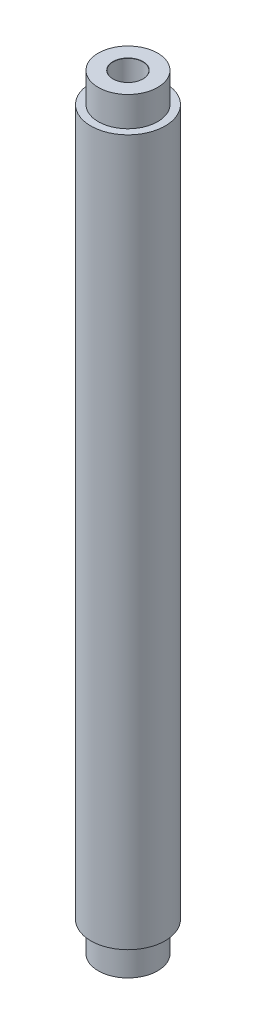
ISO-10303-21;
HEADER;
FILE_DESCRIPTION(('STEP AP214'),'2;1');
FILE_NAME('part.step','',(''),(''),'','','');
FILE_SCHEMA(('AUTOMOTIVE_DESIGN { 1 0 10303 214 1 1 1 1 }'));
ENDSEC;
DATA;
#1=APPLICATION_CONTEXT('core data for automotive mechanical design processes');
#2=APPLICATION_PROTOCOL_DEFINITION('international standard','automotive_design',2000,#1);
#3=PRODUCT_CONTEXT('',#1,'mechanical');
#4=PRODUCT('Part','Part','',(#3));
#5=PRODUCT_RELATED_PRODUCT_CATEGORY('part','',(#4));
#6=PRODUCT_DEFINITION_FORMATION('','',#4);
#7=PRODUCT_DEFINITION_CONTEXT('part definition',#1,'design');
#8=PRODUCT_DEFINITION('design','',#6,#7);
#9=PRODUCT_DEFINITION_SHAPE('','',#8);
#10=(LENGTH_UNIT() NAMED_UNIT(*) SI_UNIT(.MILLI.,.METRE.));
#11=(NAMED_UNIT(*) PLANE_ANGLE_UNIT() SI_UNIT($,.RADIAN.));
#12=(NAMED_UNIT(*) SI_UNIT($,.STERADIAN.) SOLID_ANGLE_UNIT());
#13=UNCERTAINTY_MEASURE_WITH_UNIT(LENGTH_MEASURE(1.E-05),#10,'distance_accuracy_value','');
#14=(GEOMETRIC_REPRESENTATION_CONTEXT(3) GLOBAL_UNCERTAINTY_ASSIGNED_CONTEXT((#13)) GLOBAL_UNIT_ASSIGNED_CONTEXT((#10,
#11,#12)) REPRESENTATION_CONTEXT('',''));
#15=CARTESIAN_POINT('',(0.,0.,0.));
#16=DIRECTION('',(0.,0.,1.));
#17=DIRECTION('',(1.,0.,0.));
#18=AXIS2_PLACEMENT_3D('',#15,#16,#17);
#19=CARTESIAN_POINT('',(0.,103.,0.));
#20=DIRECTION('',(0.,1.,0.));
#21=DIRECTION('',(0.,0.,1.));
#22=AXIS2_PLACEMENT_3D('',#19,#20,#21);
#23=PLANE('',#22);
#24=CARTESIAN_POINT('',(0.,103.,0.));
#25=DIRECTION('',(0.,1.,0.));
#26=DIRECTION('',(0.,0.,1.));
#27=AXIS2_PLACEMENT_3D('',#24,#25,#26);
#28=CIRCLE('',#27,2.025);
#29=CARTESIAN_POINT('',(0.,103.,2.025));
#30=VERTEX_POINT('',#29);
#31=EDGE_CURVE('E811',#30,#30,#28,.T.);
#32=ORIENTED_EDGE('',*,*,#31,.F.);
#33=EDGE_LOOP('',(#32));
#34=FACE_BOUND('',#33,.T.);
#35=CARTESIAN_POINT('',(0.,103.,0.));
#36=DIRECTION('',(0.,1.,0.));
#37=DIRECTION('',(-1.,0.,0.));
#38=AXIS2_PLACEMENT_3D('',#35,#36,#37);
#39=CIRCLE('',#38,4.);
#40=CARTESIAN_POINT('',(-4.00000000000001,103.,0.));
#41=VERTEX_POINT('',#40);
#42=EDGE_CURVE('E845',#41,#41,#39,.T.);
#43=ORIENTED_EDGE('',*,*,#42,.T.);
#44=EDGE_LOOP('',(#43));
#45=FACE_BOUND('',#44,.T.);
#46=ADVANCED_FACE('F785',(#34,#45),#23,.T.);
#47=CARTESIAN_POINT('',(0.,85.,0.));
#48=DIRECTION('',(0.,1.,0.));
#49=DIRECTION('',(0.,0.,1.));
#50=AXIS2_PLACEMENT_3D('',#47,#48,#49);
#51=CONICAL_SURFACE('',#50,2.,1.02974425867665);
#52=CARTESIAN_POINT('',(0.,83.7982787619449,0.));
#53=VERTEX_POINT('',#52);
#54=VERTEX_LOOP('',#53);
#55=FACE_BOUND('',#54,.T.);
#56=CARTESIAN_POINT('',(0.,85.,0.));
#57=DIRECTION('',(0.,1.,0.));
#58=DIRECTION('',(0.,0.,1.));
#59=AXIS2_PLACEMENT_3D('',#56,#57,#58);
#60=CIRCLE('',#59,2.);
#61=CARTESIAN_POINT('',(0.,85.,2.));
#62=VERTEX_POINT('',#61);
#63=EDGE_CURVE('E12',#62,#62,#60,.T.);
#64=ORIENTED_EDGE('',*,*,#63,.T.);
#65=EDGE_LOOP('',(#64));
#66=FACE_BOUND('',#65,.T.);
#67=ADVANCED_FACE('F841',(#55,#66),#51,.F.);
#68=CARTESIAN_POINT('',(0.,103.,0.));
#69=DIRECTION('',(0.,1.,0.));
#70=DIRECTION('',(0.,0.,1.));
#71=AXIS2_PLACEMENT_3D('',#68,#69,#70);
#72=CYLINDRICAL_SURFACE('',#71,2.);
#73=ORIENTED_EDGE('',*,*,#63,.F.);
#74=EDGE_LOOP('',(#73));
#75=FACE_BOUND('',#74,.T.);
#76=CARTESIAN_POINT('',(0.,102.975,0.));
#77=DIRECTION('',(0.,1.,0.));
#78=DIRECTION('',(0.,0.,1.));
#79=AXIS2_PLACEMENT_3D('',#76,#77,#78);
#80=CIRCLE('',#79,2.);
#81=CARTESIAN_POINT('',(0.,102.975,2.));
#82=VERTEX_POINT('',#81);
#83=EDGE_CURVE('E794',#82,#82,#80,.T.);
#84=ORIENTED_EDGE('',*,*,#83,.T.);
#85=EDGE_LOOP('',(#84));
#86=FACE_BOUND('',#85,.T.);
#87=ADVANCED_FACE('F830',(#75,#86),#72,.F.);
#88=CARTESIAN_POINT('',(0.,103.,0.));
#89=DIRECTION('',(0.,1.,0.));
#90=DIRECTION('',(0.,0.,1.));
#91=AXIS2_PLACEMENT_3D('',#88,#89,#90);
#92=CONICAL_SURFACE('',#91,2.025,0.785398163397526);
#93=ORIENTED_EDGE('',*,*,#83,.F.);
#94=EDGE_LOOP('',(#93));
#95=FACE_BOUND('',#94,.T.);
#96=ORIENTED_EDGE('',*,*,#31,.T.);
#97=EDGE_LOOP('',(#96));
#98=FACE_BOUND('',#97,.T.);
#99=ADVANCED_FACE('F832',(#95,#98),#92,.F.);
#100=CARTESIAN_POINT('',(-5.,99.,0.));
#101=DIRECTION('',(0.,-1.,0.));
#102=DIRECTION('',(1.,0.,0.));
#103=AXIS2_PLACEMENT_3D('',#100,#101,#102);
#104=PLANE('',#103);
#105=CARTESIAN_POINT('',(0.,99.,0.));
#106=DIRECTION('',(0.,1.,0.));
#107=DIRECTION('',(-1.,0.,0.));
#108=AXIS2_PLACEMENT_3D('',#105,#106,#107);
#109=CIRCLE('',#108,4.);
#110=CARTESIAN_POINT('',(-4.00000000000001,99.,0.));
#111=VERTEX_POINT('',#110);
#112=EDGE_CURVE('E848',#111,#111,#109,.T.);
#113=ORIENTED_EDGE('',*,*,#112,.F.);
#114=EDGE_LOOP('',(#113));
#115=FACE_BOUND('',#114,.T.);
#116=CARTESIAN_POINT('',(0.,99.,0.));
#117=DIRECTION('',(0.,1.,0.));
#118=DIRECTION('',(-1.,0.,0.));
#119=AXIS2_PLACEMENT_3D('',#116,#117,#118);
#120=CIRCLE('',#119,4.99999999999999);
#121=CARTESIAN_POINT('',(-5.,99.,0.));
#122=VERTEX_POINT('',#121);
#123=EDGE_CURVE('E856',#122,#122,#120,.T.);
#124=ORIENTED_EDGE('',*,*,#123,.T.);
#125=EDGE_LOOP('',(#124));
#126=FACE_BOUND('',#125,.T.);
#127=ADVANCED_FACE('F835',(#115,#126),#104,.F.);
#128=CARTESIAN_POINT('',(0.,103.,0.));
#129=DIRECTION('',(0.,1.,0.));
#130=DIRECTION('',(-1.,0.,0.));
#131=AXIS2_PLACEMENT_3D('',#128,#129,#130);
#132=CYLINDRICAL_SURFACE('',#131,4.);
#133=ORIENTED_EDGE('',*,*,#42,.F.);
#134=EDGE_LOOP('',(#133));
#135=FACE_BOUND('',#134,.T.);
#136=ORIENTED_EDGE('',*,*,#112,.T.);
#137=EDGE_LOOP('',(#136));
#138=FACE_BOUND('',#137,.T.);
#139=ADVANCED_FACE('F905',(#135,#138),#132,.T.);
#140=CARTESIAN_POINT('',(0.,103.,0.));
#141=DIRECTION('',(0.,-1.,0.));
#142=DIRECTION('',(0.,0.,-1.));
#143=AXIS2_PLACEMENT_3D('',#140,#141,#142);
#144=CYLINDRICAL_SURFACE('',#143,5.);
#145=ORIENTED_EDGE('',*,*,#123,.F.);
#146=EDGE_LOOP('',(#145));
#147=FACE_BOUND('',#146,.T.);
#148=CARTESIAN_POINT('',(0.,4.,0.));
#149=DIRECTION('',(0.,1.,0.));
#150=DIRECTION('',(-1.,0.,0.));
#151=AXIS2_PLACEMENT_3D('',#148,#149,#150);
#152=CIRCLE('',#151,4.99999999999999);
#153=CARTESIAN_POINT('',(-4.99999999999999,4.,0.));
#154=VERTEX_POINT('',#153);
#155=EDGE_CURVE('E865',#154,#154,#152,.T.);
#156=ORIENTED_EDGE('',*,*,#155,.T.);
#157=EDGE_LOOP('',(#156));
#158=FACE_BOUND('',#157,.T.);
#159=ADVANCED_FACE('F787',(#147,#158),#144,.T.);
#160=CARTESIAN_POINT('',(0.,103.,0.));
#161=DIRECTION('',(0.,1.,0.));
#162=DIRECTION('',(-1.,0.,0.));
#163=AXIS2_PLACEMENT_3D('',#160,#161,#162);
#164=CYLINDRICAL_SURFACE('',#163,4.);
#165=CARTESIAN_POINT('',(0.,4.,0.));
#166=DIRECTION('',(0.,1.,0.));
#167=DIRECTION('',(-1.,0.,0.));
#168=AXIS2_PLACEMENT_3D('',#165,#166,#167);
#169=CIRCLE('',#168,4.);
#170=CARTESIAN_POINT('',(-4.,4.,0.));
#171=VERTEX_POINT('',#170);
#172=EDGE_CURVE('E859',#171,#171,#169,.T.);
#173=ORIENTED_EDGE('',*,*,#172,.F.);
#174=EDGE_LOOP('',(#173));
#175=FACE_BOUND('',#174,.T.);
#176=CARTESIAN_POINT('',(0.,0.,0.));
#177=DIRECTION('',(0.,1.,0.));
#178=DIRECTION('',(-1.,0.,0.));
#179=AXIS2_PLACEMENT_3D('',#176,#177,#178);
#180=CIRCLE('',#179,4.);
#181=CARTESIAN_POINT('',(-4.,0.,0.));
#182=VERTEX_POINT('',#181);
#183=EDGE_CURVE('E849',#182,#182,#180,.T.);
#184=ORIENTED_EDGE('',*,*,#183,.T.);
#185=EDGE_LOOP('',(#184));
#186=FACE_BOUND('',#185,.T.);
#187=ADVANCED_FACE('F896',(#175,#186),#164,.T.);
#188=CARTESIAN_POINT('',(-4.99999999999999,4.,0.));
#189=DIRECTION('',(0.,1.,0.));
#190=DIRECTION('',(-1.,0.,0.));
#191=AXIS2_PLACEMENT_3D('',#188,#189,#190);
#192=PLANE('',#191);
#193=ORIENTED_EDGE('',*,*,#155,.F.);
#194=EDGE_LOOP('',(#193));
#195=FACE_BOUND('',#194,.T.);
#196=ORIENTED_EDGE('',*,*,#172,.T.);
#197=EDGE_LOOP('',(#196));
#198=FACE_BOUND('',#197,.T.);
#199=ADVANCED_FACE('F804',(#195,#198),#192,.F.);
#200=CARTESIAN_POINT('',(0.,18.,0.));
#201=DIRECTION('',(0.,-1.,0.));
#202=DIRECTION('',(0.,0.,-1.));
#203=AXIS2_PLACEMENT_3D('',#200,#201,#202);
#204=CONICAL_SURFACE('',#203,2.,1.02974425867665);
#205=CARTESIAN_POINT('',(0.,19.2017212380551,0.));
#206=VERTEX_POINT('',#205);
#207=VERTEX_LOOP('',#206);
#208=FACE_BOUND('',#207,.T.);
#209=CARTESIAN_POINT('',(0.,18.,0.));
#210=DIRECTION('',(0.,-1.,0.));
#211=DIRECTION('',(0.,0.,-1.));
#212=AXIS2_PLACEMENT_3D('',#209,#210,#211);
#213=CIRCLE('',#212,2.);
#214=CARTESIAN_POINT('',(0.,18.,-2.));
#215=VERTEX_POINT('',#214);
#216=EDGE_CURVE('E808',#215,#215,#213,.T.);
#217=ORIENTED_EDGE('',*,*,#216,.T.);
#218=EDGE_LOOP('',(#217));
#219=FACE_BOUND('',#218,.T.);
#220=ADVANCED_FACE('F800',(#208,#219),#204,.F.);
#221=CARTESIAN_POINT('',(0.,0.,0.));
#222=DIRECTION('',(0.,-1.,0.));
#223=DIRECTION('',(0.,0.,-1.));
#224=AXIS2_PLACEMENT_3D('',#221,#222,#223);
#225=CYLINDRICAL_SURFACE('',#224,2.);
#226=ORIENTED_EDGE('',*,*,#216,.F.);
#227=EDGE_LOOP('',(#226));
#228=FACE_BOUND('',#227,.T.);
#229=CARTESIAN_POINT('',(0.,0.0250000000000007,0.));
#230=DIRECTION('',(0.,-1.,0.));
#231=DIRECTION('',(0.,0.,-1.));
#232=AXIS2_PLACEMENT_3D('',#229,#230,#231);
#233=CIRCLE('',#232,2.);
#234=CARTESIAN_POINT('',(0.,0.0250000000000007,-2.));
#235=VERTEX_POINT('',#234);
#236=EDGE_CURVE('E812',#235,#235,#233,.T.);
#237=ORIENTED_EDGE('',*,*,#236,.T.);
#238=EDGE_LOOP('',(#237));
#239=FACE_BOUND('',#238,.T.);
#240=ADVANCED_FACE('F803',(#228,#239),#225,.F.);
#241=CARTESIAN_POINT('',(0.,0.,0.));
#242=DIRECTION('',(0.,-1.,0.));
#243=DIRECTION('',(0.,0.,-1.));
#244=AXIS2_PLACEMENT_3D('',#241,#242,#243);
#245=CONICAL_SURFACE('',#244,2.025,0.785398163397457);
#246=ORIENTED_EDGE('',*,*,#236,.F.);
#247=EDGE_LOOP('',(#246));
#248=FACE_BOUND('',#247,.T.);
#249=CARTESIAN_POINT('',(0.,0.,0.));
#250=DIRECTION('',(0.,-1.,0.));
#251=DIRECTION('',(0.,0.,-1.));
#252=AXIS2_PLACEMENT_3D('',#249,#250,#251);
#253=CIRCLE('',#252,2.025);
#254=CARTESIAN_POINT('',(0.,0.,-2.025));
#255=VERTEX_POINT('',#254);
#256=EDGE_CURVE('E821',#255,#255,#253,.T.);
#257=ORIENTED_EDGE('',*,*,#256,.T.);
#258=EDGE_LOOP('',(#257));
#259=FACE_BOUND('',#258,.T.);
#260=ADVANCED_FACE('F877',(#248,#259),#245,.F.);
#261=CARTESIAN_POINT('',(0.,0.,0.));
#262=DIRECTION('',(0.,1.,0.));
#263=DIRECTION('',(0.,0.,1.));
#264=AXIS2_PLACEMENT_3D('',#261,#262,#263);
#265=PLANE('',#264);
#266=ORIENTED_EDGE('',*,*,#183,.F.);
#267=EDGE_LOOP('',(#266));
#268=FACE_BOUND('',#267,.T.);
#269=ORIENTED_EDGE('',*,*,#256,.F.);
#270=EDGE_LOOP('',(#269));
#271=FACE_BOUND('',#270,.T.);
#272=ADVANCED_FACE('F879',(#268,#271),#265,.F.);
#273=CLOSED_SHELL('',(#46,#67,#87,#99,#127,#139,#159,#187,#199,#220,#240,#260,#272));
#274=MANIFOLD_SOLID_BREP('B2',#273);
#275=ADVANCED_BREP_SHAPE_REPRESENTATION('',(#18,#274),#14);
#276=SHAPE_DEFINITION_REPRESENTATION(#9,#275);
ENDSEC;
END-ISO-10303-21;
